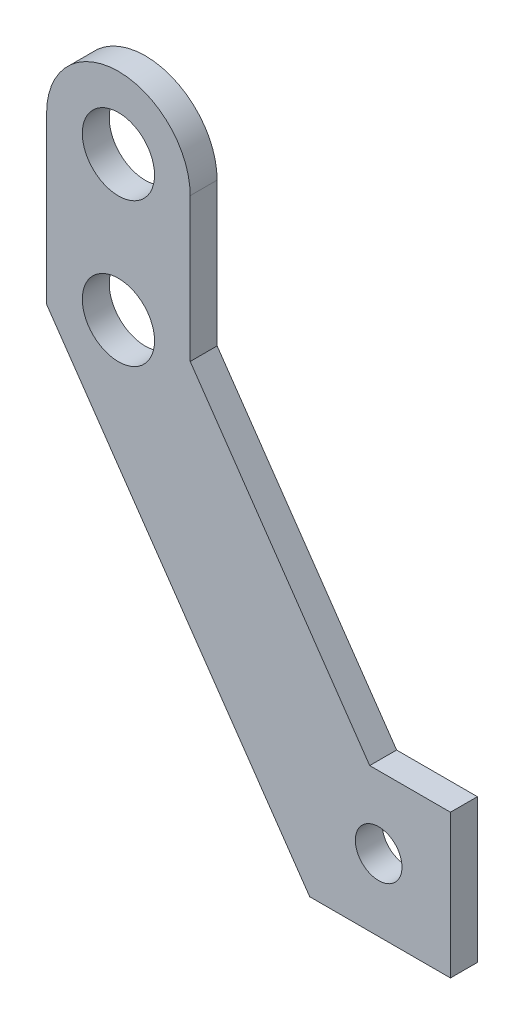
ISO-10303-21;
HEADER;
FILE_DESCRIPTION(('STEP AP214'),'2;1');
FILE_NAME('part.step','',(''),(''),'','','');
FILE_SCHEMA(('AUTOMOTIVE_DESIGN { 1 0 10303 214 1 1 1 1 }'));
ENDSEC;
DATA;
#1=APPLICATION_CONTEXT('core data for automotive mechanical design processes');
#2=APPLICATION_PROTOCOL_DEFINITION('international standard','automotive_design',2000,#1);
#3=PRODUCT_CONTEXT('',#1,'mechanical');
#4=PRODUCT('Part','Part','',(#3));
#5=PRODUCT_RELATED_PRODUCT_CATEGORY('part','',(#4));
#6=PRODUCT_DEFINITION_FORMATION('','',#4);
#7=PRODUCT_DEFINITION_CONTEXT('part definition',#1,'design');
#8=PRODUCT_DEFINITION('design','',#6,#7);
#9=PRODUCT_DEFINITION_SHAPE('','',#8);
#10=(LENGTH_UNIT() NAMED_UNIT(*) SI_UNIT(.MILLI.,.METRE.));
#11=(NAMED_UNIT(*) PLANE_ANGLE_UNIT() SI_UNIT($,.RADIAN.));
#12=(NAMED_UNIT(*) SI_UNIT($,.STERADIAN.) SOLID_ANGLE_UNIT());
#13=UNCERTAINTY_MEASURE_WITH_UNIT(LENGTH_MEASURE(1.E-05),#10,'distance_accuracy_value','');
#14=(GEOMETRIC_REPRESENTATION_CONTEXT(3) GLOBAL_UNCERTAINTY_ASSIGNED_CONTEXT((#13)) GLOBAL_UNIT_ASSIGNED_CONTEXT((#10,
#11,#12)) REPRESENTATION_CONTEXT('',''));
#15=CARTESIAN_POINT('',(0.,0.,0.));
#16=DIRECTION('',(0.,0.,1.));
#17=DIRECTION('',(1.,0.,0.));
#18=AXIS2_PLACEMENT_3D('',#15,#16,#17);
#19=CARTESIAN_POINT('',(8.,46.,3.));
#20=DIRECTION('',(0.,0.,1.));
#21=DIRECTION('',(1.,0.,0.));
#22=AXIS2_PLACEMENT_3D('',#19,#20,#21);
#23=PLANE('',#22);
#24=CARTESIAN_POINT('',(8.,46.,3.));
#25=DIRECTION('',(0.,0.,1.));
#26=DIRECTION('',(1.,0.,0.));
#27=AXIS2_PLACEMENT_3D('',#24,#25,#26);
#28=CIRCLE('',#27,4.02500000000001);
#29=CARTESIAN_POINT('',(12.025,46.,3.));
#30=VERTEX_POINT('',#29);
#31=EDGE_CURVE('E186',#30,#30,#28,.T.);
#32=ORIENTED_EDGE('',*,*,#31,.F.);
#33=EDGE_LOOP('',(#32));
#34=FACE_BOUND('',#33,.T.);
#35=DIRECTION('',(0.56773295580366,-0.823212785915306,0.));
#36=VECTOR('',#35,1.);
#37=CARTESIAN_POINT('',(0.,27.5088680369532,3.));
#38=LINE('',#37,#36);
#39=CARTESIAN_POINT('',(0.,27.5088680369532,3.));
#40=VERTEX_POINT('',#39);
#41=CARTESIAN_POINT('',(29.3164607151401,-15.,3.));
#42=VERTEX_POINT('',#41);
#43=EDGE_CURVE('E149',#40,#42,#38,.T.);
#44=ORIENTED_EDGE('',*,*,#43,.T.);
#45=DIRECTION('',(1.,0.,0.));
#46=VECTOR('',#45,1.);
#47=CARTESIAN_POINT('',(29.3164607151401,-15.,3.));
#48=LINE('',#47,#46);
#49=CARTESIAN_POINT('',(45.,-15.,3.));
#50=VERTEX_POINT('',#49);
#51=EDGE_CURVE('E97',#42,#50,#48,.T.);
#52=ORIENTED_EDGE('',*,*,#51,.T.);
#53=DIRECTION('',(0.,1.,0.));
#54=VECTOR('',#53,1.);
#55=CARTESIAN_POINT('',(45.,-15.,3.));
#56=LINE('',#55,#54);
#57=CARTESIAN_POINT('',(45.,1.,3.));
#58=VERTEX_POINT('',#57);
#59=EDGE_CURVE('E164',#50,#58,#56,.T.);
#60=ORIENTED_EDGE('',*,*,#59,.T.);
#61=DIRECTION('',(-1.,0.,0.));
#62=VECTOR('',#61,1.);
#63=CARTESIAN_POINT('',(45.,1.,3.));
#64=LINE('',#63,#62);
#65=CARTESIAN_POINT('',(36.,1.,3.));
#66=VERTEX_POINT('',#65);
#67=EDGE_CURVE('E177',#58,#66,#64,.T.);
#68=ORIENTED_EDGE('',*,*,#67,.T.);
#69=DIRECTION('',(-0.56773295580366,0.823212785915306,0.));
#70=VECTOR('',#69,1.);
#71=CARTESIAN_POINT('',(16.,30.,3.));
#72=LINE('',#71,#70);
#73=CARTESIAN_POINT('',(16.,30.,3.));
#74=VERTEX_POINT('',#73);
#75=EDGE_CURVE('E116',#66,#74,#72,.T.);
#76=ORIENTED_EDGE('',*,*,#75,.T.);
#77=DIRECTION('',(0.,1.,0.));
#78=VECTOR('',#77,1.);
#79=CARTESIAN_POINT('',(16.,30.,3.));
#80=LINE('',#79,#78);
#81=CARTESIAN_POINT('',(16.,46.,3.));
#82=VERTEX_POINT('',#81);
#83=EDGE_CURVE('E110',#74,#82,#80,.T.);
#84=ORIENTED_EDGE('',*,*,#83,.T.);
#85=CARTESIAN_POINT('',(8.,46.,3.));
#86=DIRECTION('',(0.,0.,1.));
#87=DIRECTION('',(1.,0.,0.));
#88=AXIS2_PLACEMENT_3D('',#85,#86,#87);
#89=CIRCLE('',#88,8.);
#90=CARTESIAN_POINT('',(0.,46.,3.));
#91=VERTEX_POINT('',#90);
#92=EDGE_CURVE('E114',#82,#91,#89,.T.);
#93=ORIENTED_EDGE('',*,*,#92,.T.);
#94=DIRECTION('',(0.,-1.,0.));
#95=VECTOR('',#94,1.);
#96=CARTESIAN_POINT('',(0.,46.,3.));
#97=LINE('',#96,#95);
#98=EDGE_CURVE('E54',#91,#40,#97,.T.);
#99=ORIENTED_EDGE('',*,*,#98,.T.);
#100=EDGE_LOOP('',(#44,#52,#60,#68,#76,#84,#93,#99));
#101=FACE_BOUND('',#100,.T.);
#102=CARTESIAN_POINT('',(37.,-7.,3.));
#103=DIRECTION('',(0.,0.,1.));
#104=DIRECTION('',(1.,0.,0.));
#105=AXIS2_PLACEMENT_3D('',#102,#103,#104);
#106=CIRCLE('',#105,2.6);
#107=CARTESIAN_POINT('',(39.6,-7.,3.));
#108=VERTEX_POINT('',#107);
#109=EDGE_CURVE('E138',#108,#108,#106,.T.);
#110=ORIENTED_EDGE('',*,*,#109,.F.);
#111=EDGE_LOOP('',(#110));
#112=FACE_BOUND('',#111,.T.);
#113=CARTESIAN_POINT('',(7.99999999999999,30.,3.));
#114=DIRECTION('',(0.,0.,1.));
#115=DIRECTION('',(1.,0.,0.));
#116=AXIS2_PLACEMENT_3D('',#113,#114,#115);
#117=CIRCLE('',#116,4.02500000000001);
#118=CARTESIAN_POINT('',(12.025,30.,3.));
#119=VERTEX_POINT('',#118);
#120=EDGE_CURVE('E192',#119,#119,#117,.T.);
#121=ORIENTED_EDGE('',*,*,#120,.F.);
#122=EDGE_LOOP('',(#121));
#123=FACE_BOUND('',#122,.T.);
#124=ADVANCED_FACE('F37',(#34,#101,#112,#123),#23,.T.);
#125=CARTESIAN_POINT('',(8.,46.,0.));
#126=DIRECTION('',(0.,0.,1.));
#127=DIRECTION('',(1.,0.,0.));
#128=AXIS2_PLACEMENT_3D('',#125,#126,#127);
#129=PLANE('',#128);
#130=DIRECTION('',(0.56773295580366,-0.823212785915306,0.));
#131=VECTOR('',#130,1.);
#132=CARTESIAN_POINT('',(0.,27.5088680369532,0.));
#133=LINE('',#132,#131);
#134=CARTESIAN_POINT('',(0.,27.5088680369532,0.));
#135=VERTEX_POINT('',#134);
#136=CARTESIAN_POINT('',(29.3164607151401,-15.,0.));
#137=VERTEX_POINT('',#136);
#138=EDGE_CURVE('E134',#135,#137,#133,.T.);
#139=ORIENTED_EDGE('',*,*,#138,.F.);
#140=DIRECTION('',(0.,-1.,0.));
#141=VECTOR('',#140,1.);
#142=CARTESIAN_POINT('',(0.,46.,0.));
#143=LINE('',#142,#141);
#144=CARTESIAN_POINT('',(0.,46.,0.));
#145=VERTEX_POINT('',#144);
#146=EDGE_CURVE('E89',#145,#135,#143,.T.);
#147=ORIENTED_EDGE('',*,*,#146,.F.);
#148=CARTESIAN_POINT('',(8.,46.,0.));
#149=DIRECTION('',(0.,0.,1.));
#150=DIRECTION('',(1.,0.,0.));
#151=AXIS2_PLACEMENT_3D('',#148,#149,#150);
#152=CIRCLE('',#151,8.);
#153=CARTESIAN_POINT('',(16.,46.,0.));
#154=VERTEX_POINT('',#153);
#155=EDGE_CURVE('E83',#154,#145,#152,.T.);
#156=ORIENTED_EDGE('',*,*,#155,.F.);
#157=DIRECTION('',(0.,1.,0.));
#158=VECTOR('',#157,1.);
#159=CARTESIAN_POINT('',(16.,30.,0.));
#160=LINE('',#159,#158);
#161=CARTESIAN_POINT('',(16.,30.,0.));
#162=VERTEX_POINT('',#161);
#163=EDGE_CURVE('E124',#162,#154,#160,.T.);
#164=ORIENTED_EDGE('',*,*,#163,.F.);
#165=DIRECTION('',(-0.56773295580366,0.823212785915306,0.));
#166=VECTOR('',#165,1.);
#167=CARTESIAN_POINT('',(16.,30.,0.));
#168=LINE('',#167,#166);
#169=CARTESIAN_POINT('',(36.,1.,0.));
#170=VERTEX_POINT('',#169);
#171=EDGE_CURVE('E144',#170,#162,#168,.T.);
#172=ORIENTED_EDGE('',*,*,#171,.F.);
#173=DIRECTION('',(-1.,0.,0.));
#174=VECTOR('',#173,1.);
#175=CARTESIAN_POINT('',(45.,1.,0.));
#176=LINE('',#175,#174);
#177=CARTESIAN_POINT('',(45.,1.,0.));
#178=VERTEX_POINT('',#177);
#179=EDGE_CURVE('E142',#178,#170,#176,.T.);
#180=ORIENTED_EDGE('',*,*,#179,.F.);
#181=DIRECTION('',(0.,1.,0.));
#182=VECTOR('',#181,1.);
#183=CARTESIAN_POINT('',(45.,-15.,0.));
#184=LINE('',#183,#182);
#185=CARTESIAN_POINT('',(45.,-15.,0.));
#186=VERTEX_POINT('',#185);
#187=EDGE_CURVE('E140',#186,#178,#184,.T.);
#188=ORIENTED_EDGE('',*,*,#187,.F.);
#189=DIRECTION('',(1.,0.,0.));
#190=VECTOR('',#189,1.);
#191=CARTESIAN_POINT('',(29.3164607151401,-15.,0.));
#192=LINE('',#191,#190);
#193=EDGE_CURVE('E137',#137,#186,#192,.T.);
#194=ORIENTED_EDGE('',*,*,#193,.F.);
#195=EDGE_LOOP('',(#139,#147,#156,#164,#172,#180,#188,#194));
#196=FACE_BOUND('',#195,.T.);
#197=CARTESIAN_POINT('',(37.,-7.,0.));
#198=DIRECTION('',(0.,0.,1.));
#199=DIRECTION('',(1.,0.,0.));
#200=AXIS2_PLACEMENT_3D('',#197,#198,#199);
#201=CIRCLE('',#200,2.6);
#202=CARTESIAN_POINT('',(39.6,-7.,0.));
#203=VERTEX_POINT('',#202);
#204=EDGE_CURVE('E183',#203,#203,#201,.T.);
#205=ORIENTED_EDGE('',*,*,#204,.T.);
#206=EDGE_LOOP('',(#205));
#207=FACE_BOUND('',#206,.T.);
#208=CARTESIAN_POINT('',(8.,46.,0.));
#209=DIRECTION('',(0.,0.,1.));
#210=DIRECTION('',(1.,0.,0.));
#211=AXIS2_PLACEMENT_3D('',#208,#209,#210);
#212=CIRCLE('',#211,4.02500000000001);
#213=CARTESIAN_POINT('',(12.025,46.,0.));
#214=VERTEX_POINT('',#213);
#215=EDGE_CURVE('E189',#214,#214,#212,.T.);
#216=ORIENTED_EDGE('',*,*,#215,.T.);
#217=EDGE_LOOP('',(#216));
#218=FACE_BOUND('',#217,.T.);
#219=CARTESIAN_POINT('',(7.99999999999999,30.,0.));
#220=DIRECTION('',(0.,0.,1.));
#221=DIRECTION('',(1.,0.,0.));
#222=AXIS2_PLACEMENT_3D('',#219,#220,#221);
#223=CIRCLE('',#222,4.02500000000001);
#224=CARTESIAN_POINT('',(12.025,30.,0.));
#225=VERTEX_POINT('',#224);
#226=EDGE_CURVE('E195',#225,#225,#223,.T.);
#227=ORIENTED_EDGE('',*,*,#226,.T.);
#228=EDGE_LOOP('',(#227));
#229=FACE_BOUND('',#228,.T.);
#230=ADVANCED_FACE('F168',(#196,#207,#218,#229),#129,.F.);
#231=CARTESIAN_POINT('',(0.,27.5088680369532,3.));
#232=DIRECTION('',(0.823212785915306,0.56773295580366,0.));
#233=DIRECTION('',(-0.56773295580366,0.823212785915306,0.));
#234=AXIS2_PLACEMENT_3D('',#231,#232,#233);
#235=PLANE('',#234);
#236=ORIENTED_EDGE('',*,*,#138,.T.);
#237=DIRECTION('',(0.,0.,-1.));
#238=VECTOR('',#237,1.);
#239=CARTESIAN_POINT('',(29.3164607151401,-15.,3.));
#240=LINE('',#239,#238);
#241=EDGE_CURVE('E11',#42,#137,#240,.T.);
#242=ORIENTED_EDGE('',*,*,#241,.F.);
#243=ORIENTED_EDGE('',*,*,#43,.F.);
#244=DIRECTION('',(0.,0.,-1.));
#245=VECTOR('',#244,1.);
#246=CARTESIAN_POINT('',(0.,27.5088680369532,3.));
#247=LINE('',#246,#245);
#248=EDGE_CURVE('E130',#40,#135,#247,.T.);
#249=ORIENTED_EDGE('',*,*,#248,.T.);
#250=EDGE_LOOP('',(#236,#242,#243,#249));
#251=FACE_BOUND('',#250,.T.);
#252=ADVANCED_FACE('F39',(#251),#235,.F.);
#253=CARTESIAN_POINT('',(29.3164607151401,-15.,3.));
#254=DIRECTION('',(0.,1.,0.));
#255=DIRECTION('',(0.,0.,1.));
#256=AXIS2_PLACEMENT_3D('',#253,#254,#255);
#257=PLANE('',#256);
#258=ORIENTED_EDGE('',*,*,#193,.T.);
#259=DIRECTION('',(0.,0.,-1.));
#260=VECTOR('',#259,1.);
#261=CARTESIAN_POINT('',(45.,-15.,3.));
#262=LINE('',#261,#260);
#263=EDGE_CURVE('E46',#50,#186,#262,.T.);
#264=ORIENTED_EDGE('',*,*,#263,.F.);
#265=ORIENTED_EDGE('',*,*,#51,.F.);
#266=ORIENTED_EDGE('',*,*,#241,.T.);
#267=EDGE_LOOP('',(#258,#264,#265,#266));
#268=FACE_BOUND('',#267,.T.);
#269=ADVANCED_FACE('F228',(#268),#257,.F.);
#270=CARTESIAN_POINT('',(45.,-15.,3.));
#271=DIRECTION('',(-1.,0.,0.));
#272=DIRECTION('',(0.,0.,1.));
#273=AXIS2_PLACEMENT_3D('',#270,#271,#272);
#274=PLANE('',#273);
#275=ORIENTED_EDGE('',*,*,#187,.T.);
#276=DIRECTION('',(0.,0.,-1.));
#277=VECTOR('',#276,1.);
#278=CARTESIAN_POINT('',(45.,1.,3.));
#279=LINE('',#278,#277);
#280=EDGE_CURVE('E156',#58,#178,#279,.T.);
#281=ORIENTED_EDGE('',*,*,#280,.F.);
#282=ORIENTED_EDGE('',*,*,#59,.F.);
#283=ORIENTED_EDGE('',*,*,#263,.T.);
#284=EDGE_LOOP('',(#275,#281,#282,#283));
#285=FACE_BOUND('',#284,.T.);
#286=ADVANCED_FACE('F162',(#285),#274,.F.);
#287=CARTESIAN_POINT('',(45.,1.,3.));
#288=DIRECTION('',(0.,-1.,0.));
#289=DIRECTION('',(1.,0.,0.));
#290=AXIS2_PLACEMENT_3D('',#287,#288,#289);
#291=PLANE('',#290);
#292=ORIENTED_EDGE('',*,*,#179,.T.);
#293=DIRECTION('',(0.,0.,-1.));
#294=VECTOR('',#293,1.);
#295=CARTESIAN_POINT('',(36.,1.,3.));
#296=LINE('',#295,#294);
#297=EDGE_CURVE('E153',#66,#170,#296,.T.);
#298=ORIENTED_EDGE('',*,*,#297,.F.);
#299=ORIENTED_EDGE('',*,*,#67,.F.);
#300=ORIENTED_EDGE('',*,*,#280,.T.);
#301=EDGE_LOOP('',(#292,#298,#299,#300));
#302=FACE_BOUND('',#301,.T.);
#303=ADVANCED_FACE('F173',(#302),#291,.F.);
#304=CARTESIAN_POINT('',(16.,30.,3.));
#305=DIRECTION('',(-0.823212785915306,-0.56773295580366,0.));
#306=DIRECTION('',(0.56773295580366,-0.823212785915306,0.));
#307=AXIS2_PLACEMENT_3D('',#304,#305,#306);
#308=PLANE('',#307);
#309=ORIENTED_EDGE('',*,*,#171,.T.);
#310=DIRECTION('',(0.,0.,-1.));
#311=VECTOR('',#310,1.);
#312=CARTESIAN_POINT('',(16.,30.,3.));
#313=LINE('',#312,#311);
#314=EDGE_CURVE('E125',#74,#162,#313,.T.);
#315=ORIENTED_EDGE('',*,*,#314,.F.);
#316=ORIENTED_EDGE('',*,*,#75,.F.);
#317=ORIENTED_EDGE('',*,*,#297,.T.);
#318=EDGE_LOOP('',(#309,#315,#316,#317));
#319=FACE_BOUND('',#318,.T.);
#320=ADVANCED_FACE('F176',(#319),#308,.F.);
#321=CARTESIAN_POINT('',(16.,30.,3.));
#322=DIRECTION('',(-1.,0.,0.));
#323=DIRECTION('',(0.,0.,1.));
#324=AXIS2_PLACEMENT_3D('',#321,#322,#323);
#325=PLANE('',#324);
#326=ORIENTED_EDGE('',*,*,#163,.T.);
#327=DIRECTION('',(0.,0.,-1.));
#328=VECTOR('',#327,1.);
#329=CARTESIAN_POINT('',(16.,46.,3.));
#330=LINE('',#329,#328);
#331=EDGE_CURVE('E121',#82,#154,#330,.T.);
#332=ORIENTED_EDGE('',*,*,#331,.F.);
#333=ORIENTED_EDGE('',*,*,#83,.F.);
#334=ORIENTED_EDGE('',*,*,#314,.T.);
#335=EDGE_LOOP('',(#326,#332,#333,#334));
#336=FACE_BOUND('',#335,.T.);
#337=ADVANCED_FACE('F122',(#336),#325,.F.);
#338=CARTESIAN_POINT('',(8.,46.,3.));
#339=DIRECTION('',(0.,0.,-1.));
#340=DIRECTION('',(-1.,0.,0.));
#341=AXIS2_PLACEMENT_3D('',#338,#339,#340);
#342=CYLINDRICAL_SURFACE('',#341,8.);
#343=ORIENTED_EDGE('',*,*,#155,.T.);
#344=DIRECTION('',(0.,0.,-1.));
#345=VECTOR('',#344,1.);
#346=CARTESIAN_POINT('',(0.,46.,3.));
#347=LINE('',#346,#345);
#348=EDGE_CURVE('E126',#91,#145,#347,.T.);
#349=ORIENTED_EDGE('',*,*,#348,.F.);
#350=ORIENTED_EDGE('',*,*,#92,.F.);
#351=ORIENTED_EDGE('',*,*,#331,.T.);
#352=EDGE_LOOP('',(#343,#349,#350,#351));
#353=FACE_BOUND('',#352,.T.);
#354=ADVANCED_FACE('F128',(#353),#342,.T.);
#355=CARTESIAN_POINT('',(0.,46.,3.));
#356=DIRECTION('',(1.,0.,0.));
#357=DIRECTION('',(0.,1.,0.));
#358=AXIS2_PLACEMENT_3D('',#355,#356,#357);
#359=PLANE('',#358);
#360=ORIENTED_EDGE('',*,*,#146,.T.);
#361=ORIENTED_EDGE('',*,*,#248,.F.);
#362=ORIENTED_EDGE('',*,*,#98,.F.);
#363=ORIENTED_EDGE('',*,*,#348,.T.);
#364=EDGE_LOOP('',(#360,#361,#362,#363));
#365=FACE_BOUND('',#364,.T.);
#366=ADVANCED_FACE('F216',(#365),#359,.F.);
#367=CARTESIAN_POINT('',(37.,-7.,3.));
#368=DIRECTION('',(0.,0.,-1.));
#369=DIRECTION('',(-1.,0.,0.));
#370=AXIS2_PLACEMENT_3D('',#367,#368,#369);
#371=CYLINDRICAL_SURFACE('',#370,2.6);
#372=ORIENTED_EDGE('',*,*,#109,.T.);
#373=EDGE_LOOP('',(#372));
#374=FACE_BOUND('',#373,.T.);
#375=ORIENTED_EDGE('',*,*,#204,.F.);
#376=EDGE_LOOP('',(#375));
#377=FACE_BOUND('',#376,.T.);
#378=ADVANCED_FACE('F213',(#374,#377),#371,.F.);
#379=CARTESIAN_POINT('',(8.,46.,3.));
#380=DIRECTION('',(0.,0.,-1.));
#381=DIRECTION('',(-1.,0.,0.));
#382=AXIS2_PLACEMENT_3D('',#379,#380,#381);
#383=CYLINDRICAL_SURFACE('',#382,4.02500000000001);
#384=ORIENTED_EDGE('',*,*,#31,.T.);
#385=EDGE_LOOP('',(#384));
#386=FACE_BOUND('',#385,.T.);
#387=ORIENTED_EDGE('',*,*,#215,.F.);
#388=EDGE_LOOP('',(#387));
#389=FACE_BOUND('',#388,.T.);
#390=ADVANCED_FACE('F304',(#386,#389),#383,.F.);
#391=CARTESIAN_POINT('',(7.99999999999999,30.,3.));
#392=DIRECTION('',(0.,0.,-1.));
#393=DIRECTION('',(-1.,0.,0.));
#394=AXIS2_PLACEMENT_3D('',#391,#392,#393);
#395=CYLINDRICAL_SURFACE('',#394,4.02500000000001);
#396=ORIENTED_EDGE('',*,*,#120,.T.);
#397=EDGE_LOOP('',(#396));
#398=FACE_BOUND('',#397,.T.);
#399=ORIENTED_EDGE('',*,*,#226,.F.);
#400=EDGE_LOOP('',(#399));
#401=FACE_BOUND('',#400,.T.);
#402=ADVANCED_FACE('F201',(#398,#401),#395,.F.);
#403=CLOSED_SHELL('',(#124,#230,#252,#269,#286,#303,#320,#337,#354,#366,#378,#390,#402));
#404=MANIFOLD_SOLID_BREP('B2',#403);
#405=ADVANCED_BREP_SHAPE_REPRESENTATION('',(#18,#404),#14);
#406=SHAPE_DEFINITION_REPRESENTATION(#9,#405);
ENDSEC;
END-ISO-10303-21;
